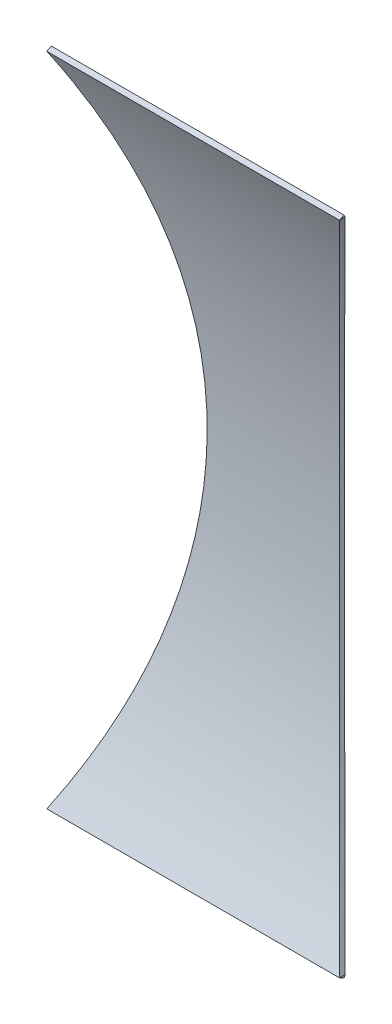
ISO-10303-21;
HEADER;
FILE_DESCRIPTION(('STEP AP214'),'2;1');
FILE_NAME('part.step','',(''),(''),'','','');
FILE_SCHEMA(('AUTOMOTIVE_DESIGN { 1 0 10303 214 1 1 1 1 }'));
ENDSEC;
DATA;
#1=APPLICATION_CONTEXT('core data for automotive mechanical design processes');
#2=APPLICATION_PROTOCOL_DEFINITION('international standard','automotive_design',2000,#1);
#3=PRODUCT_CONTEXT('',#1,'mechanical');
#4=PRODUCT('Part','Part','',(#3));
#5=PRODUCT_RELATED_PRODUCT_CATEGORY('part','',(#4));
#6=PRODUCT_DEFINITION_FORMATION('','',#4);
#7=PRODUCT_DEFINITION_CONTEXT('part definition',#1,'design');
#8=PRODUCT_DEFINITION('design','',#6,#7);
#9=PRODUCT_DEFINITION_SHAPE('','',#8);
#10=(LENGTH_UNIT() NAMED_UNIT(*) SI_UNIT(.MILLI.,.METRE.));
#11=(NAMED_UNIT(*) PLANE_ANGLE_UNIT() SI_UNIT($,.RADIAN.));
#12=(NAMED_UNIT(*) SI_UNIT($,.STERADIAN.) SOLID_ANGLE_UNIT());
#13=UNCERTAINTY_MEASURE_WITH_UNIT(LENGTH_MEASURE(1.E-05),#10,'distance_accuracy_value','');
#14=(GEOMETRIC_REPRESENTATION_CONTEXT(3) GLOBAL_UNCERTAINTY_ASSIGNED_CONTEXT((#13)) GLOBAL_UNIT_ASSIGNED_CONTEXT((#10,
#11,#12)) REPRESENTATION_CONTEXT('',''));
#15=CARTESIAN_POINT('',(0.,0.,0.));
#16=DIRECTION('',(0.,0.,1.));
#17=DIRECTION('',(1.,0.,0.));
#18=AXIS2_PLACEMENT_3D('',#15,#16,#17);
#19=CARTESIAN_POINT('',(0.,0.,247.991935352745));
#20=DIRECTION('',(1.,0.,0.));
#21=DIRECTION('',(0.,0.,-1.));
#22=AXIS2_PLACEMENT_3D('',#19,#20,#21);
#23=PLANE('',#22);
#24=DIRECTION('',(0.,0.,1.));
#25=VECTOR('',#24,1.);
#26=CARTESIAN_POINT('',(0.,130.,-34.0080646472551));
#27=LINE('',#26,#25);
#28=CARTESIAN_POINT('',(0.,130.,-2.25594176112778));
#29=VERTEX_POINT('',#28);
#30=CARTESIAN_POINT('',(0.,130.,0.));
#31=VERTEX_POINT('',#30);
#32=EDGE_CURVE('E11',#29,#31,#27,.T.);
#33=ORIENTED_EDGE('',*,*,#32,.F.);
#34=CARTESIAN_POINT('',(0.,0.,247.991935352745));
#35=DIRECTION('',(1.,0.,0.));
#36=DIRECTION('',(0.,0.,-1.));
#37=AXIS2_PLACEMENT_3D('',#34,#35,#36);
#38=CIRCLE('',#37,282.);
#39=CARTESIAN_POINT('',(0.,130.928571428571,-1.77137096680536));
#40=VERTEX_POINT('',#39);
#41=EDGE_CURVE('E81',#29,#40,#38,.T.);
#42=ORIENTED_EDGE('',*,*,#41,.T.);
#43=DIRECTION('',(0.,-0.464285714285713,0.885685483402661));
#44=VECTOR('',#43,1.);
#45=CARTESIAN_POINT('',(0.,130.,0.));
#46=LINE('',#45,#44);
#47=EDGE_CURVE('E84',#40,#31,#46,.T.);
#48=ORIENTED_EDGE('',*,*,#47,.T.);
#49=EDGE_LOOP('',(#33,#42,#48));
#50=FACE_BOUND('',#49,.T.);
#51=ADVANCED_FACE('F39',(#50),#23,.T.);
#52=CARTESIAN_POINT('',(-116.,0.,247.991935352745));
#53=DIRECTION('',(1.,0.,0.));
#54=DIRECTION('',(0.,0.,-1.));
#55=AXIS2_PLACEMENT_3D('',#52,#53,#54);
#56=PLANE('',#55);
#57=CARTESIAN_POINT('',(-116.,0.,247.991935352745));
#58=DIRECTION('',(1.,0.,0.));
#59=DIRECTION('',(0.,0.,-1.));
#60=AXIS2_PLACEMENT_3D('',#57,#58,#59);
#61=CIRCLE('',#60,282.);
#62=CARTESIAN_POINT('',(-116.,130.,-2.25594176112789));
#63=VERTEX_POINT('',#62);
#64=CARTESIAN_POINT('',(-116.,130.928571428571,-1.77137096680536));
#65=VERTEX_POINT('',#64);
#66=EDGE_CURVE('E63',#63,#65,#61,.T.);
#67=ORIENTED_EDGE('',*,*,#66,.F.);
#68=DIRECTION('',(0.,0.,1.));
#69=VECTOR('',#68,1.);
#70=CARTESIAN_POINT('',(-116.,130.,-34.0080646472551));
#71=LINE('',#70,#69);
#72=CARTESIAN_POINT('',(-116.,130.,0.));
#73=VERTEX_POINT('',#72);
#74=EDGE_CURVE('E116',#63,#73,#71,.T.);
#75=ORIENTED_EDGE('',*,*,#74,.T.);
#76=DIRECTION('',(0.,-0.464285714285713,0.885685483402661));
#77=VECTOR('',#76,1.);
#78=CARTESIAN_POINT('',(-116.,130.,0.));
#79=LINE('',#78,#77);
#80=EDGE_CURVE('E114',#65,#73,#79,.T.);
#81=ORIENTED_EDGE('',*,*,#80,.F.);
#82=EDGE_LOOP('',(#67,#75,#81));
#83=FACE_BOUND('',#82,.T.);
#84=ADVANCED_FACE('F171',(#83),#56,.F.);
#85=CARTESIAN_POINT('',(-116.,0.,247.991935352745));
#86=DIRECTION('',(1.,0.,0.));
#87=DIRECTION('',(0.,0.,-1.));
#88=AXIS2_PLACEMENT_3D('',#85,#86,#87);
#89=CYLINDRICAL_SURFACE('',#88,280.);
#90=CARTESIAN_POINT('',(247.991935352745,0.,247.991935352745));
#91=DIRECTION('',(0.707106781186547,0.,-0.707106781186548));
#92=DIRECTION('',(0.707106781186547,0.,0.707106781186548));
#93=AXIS2_PLACEMENT_3D('',#90,#91,#92);
#94=ELLIPSE('',#93,395.979797464467,280.);
#95=CARTESIAN_POINT('',(0.,-130.,0.));
#96=VERTEX_POINT('',#95);
#97=EDGE_CURVE('E126',#31,#96,#94,.F.);
#98=ORIENTED_EDGE('',*,*,#97,.F.);
#99=DIRECTION('',(1.,0.,0.));
#100=VECTOR('',#99,1.);
#101=CARTESIAN_POINT('',(-116.,130.,0.));
#102=LINE('',#101,#100);
#103=EDGE_CURVE('E95',#73,#31,#102,.T.);
#104=ORIENTED_EDGE('',*,*,#103,.F.);
#105=CARTESIAN_POINT('',(-116.,-130.,0.));
#106=CARTESIAN_POINT('',(-114.722723330829,-127.524162938112,-1.29787727621307));
#107=CARTESIAN_POINT('',(-113.475343646027,-125.016654774825,-2.5650570089339));
#108=CARTESIAN_POINT('',(-111.043760146061,-119.939533424443,-5.03469579068115));
#109=CARTESIAN_POINT('',(-109.859562959161,-117.369913762366,-6.23714804948319));
#110=CARTESIAN_POINT('',(-107.557017225669,-112.168116071115,-8.57472600666595));
#111=CARTESIAN_POINT('',(-106.438725500063,-109.535886728974,-9.70979361477241));
#112=CARTESIAN_POINT('',(-104.272701561712,-104.21303579432,-11.9079180963217));
#113=CARTESIAN_POINT('',(-103.224967370836,-101.52241584163,-12.970976988586));
#114=CARTESIAN_POINT('',(-101.19811165675,-96.0702635021348,-15.0271494382682));
#115=CARTESIAN_POINT('',(-100.219395231419,-93.3084245406909,-16.0198501788659));
#116=CARTESIAN_POINT('',(-98.3405208987038,-87.7308943374464,-17.9252979664128));
#117=CARTESIAN_POINT('',(-97.4403636225072,-84.9152026631844,-18.8380443709644));
#118=CARTESIAN_POINT('',(-95.7223884858511,-79.2340438699705,-20.5798264819451));
#119=CARTESIAN_POINT('',(-94.9045502470825,-76.3685892769392,-21.4088829062119));
#120=CARTESIAN_POINT('',(-93.3543904447992,-70.5910751649641,-22.9801334090334));
#121=CARTESIAN_POINT('',(-92.62206872685,-67.6790157301948,-23.7223276444527));
#122=CARTESIAN_POINT('',(-91.2424364093004,-61.796651332234,-25.1204271978503));
#123=CARTESIAN_POINT('',(-90.5956104083632,-58.8261155585997,-25.7758406668304));
#124=CARTESIAN_POINT('',(-89.3947277280218,-52.8472190948232,-26.9925700146317));
#125=CARTESIAN_POINT('',(-88.8406712025796,-49.8388583419148,-27.5538857372867));
#126=CARTESIAN_POINT('',(-87.8280057897651,-43.789428051778,-28.5797527770302));
#127=CARTESIAN_POINT('',(-87.3694055000559,-40.7483555941546,-29.044295377848));
#128=CARTESIAN_POINT('',(-86.5500569512581,-34.6395937424088,-29.8742191114178));
#129=CARTESIAN_POINT('',(-86.1893084259521,-31.5719044207242,-30.2396005139495));
#130=CARTESIAN_POINT('',(-85.5686159902112,-25.4265479797368,-30.8682416383489));
#131=CARTESIAN_POINT('',(-85.3083339095689,-22.3489501235614,-31.1318439497253));
#132=CARTESIAN_POINT('',(-84.8882338622004,-16.1798672768381,-31.5572936687292));
#133=CARTESIAN_POINT('',(-84.7284162511558,-13.0883822371635,-31.7191407161052));
#134=CARTESIAN_POINT('',(-84.5101243973419,-6.89843316565551,-31.9402027873517));
#135=CARTESIAN_POINT('',(-84.4516415782102,-3.79996974665675,-31.9994264966394));
#136=CARTESIAN_POINT('',(-84.4363158758933,2.39743458594207,-32.0149464514879));
#137=CARTESIAN_POINT('',(-84.4794712957186,5.49637549070603,-31.9712444155351));
#138=CARTESIAN_POINT('',(-84.6600423377646,11.4527262818252,-31.7883825773702));
#139=CARTESIAN_POINT('',(-84.7900467065086,14.3105971113168,-31.6567281780365));
#140=CARTESIAN_POINT('',(-85.136013869669,20.0157415064872,-31.3063596707759));
#141=CARTESIAN_POINT('',(-85.3519753117135,22.86301523818,-31.0876469325472));
#142=CARTESIAN_POINT('',(-85.8688599935113,28.5418072668753,-30.5641557395125));
#143=CARTESIAN_POINT('',(-86.1697811860132,31.3733259418467,-30.259379358558));
#144=CARTESIAN_POINT('',(-86.8552342610493,37.0157756563583,-29.56510789991));
#145=CARTESIAN_POINT('',(-87.2397664742604,39.8267066144298,-29.1756124871576));
#146=CARTESIAN_POINT('',(-88.0918886732042,45.4307574495006,-28.312435588121));
#147=CARTESIAN_POINT('',(-88.5596972651142,48.2238099008621,-27.8385325241471));
#148=CARTESIAN_POINT('',(-89.5756790468747,53.7801078385699,-26.8092347696776));
#149=CARTESIAN_POINT('',(-90.1238524979642,56.5433532279922,-26.2538398142795));
#150=CARTESIAN_POINT('',(-91.2982653639441,62.0357520748552,-25.063847842397));
#151=CARTESIAN_POINT('',(-91.9244994066936,64.7649078641404,-24.4292562762308));
#152=CARTESIAN_POINT('',(-93.2525906929677,70.1855733129682,-23.0833013690732));
#153=CARTESIAN_POINT('',(-93.9544469569309,72.877083459638,-22.3719390225206));
#154=CARTESIAN_POINT('',(-95.3646474465555,77.9785642819669,-20.942471226618));
#155=CARTESIAN_POINT('',(-96.0667170124749,80.3920635547061,-20.2307404834665));
#156=CARTESIAN_POINT('',(-97.5292650116236,85.1830557810643,-18.7478920362414));
#157=CARTESIAN_POINT('',(-98.2897478340257,87.5605460128629,-17.9767698694836));
#158=CARTESIAN_POINT('',(-99.86694445199,92.2773478935686,-16.3773006619038));
#159=CARTESIAN_POINT('',(-100.683659360368,94.6166587857844,-15.5489524885956));
#160=CARTESIAN_POINT('',(-102.371133474134,99.2553089941615,-13.8371988942839));
#161=CARTESIAN_POINT('',(-103.241893213486,101.554647915112,-12.9537929293088));
#162=CARTESIAN_POINT('',(-105.030446824835,106.099589949925,-11.1389823208349));
#163=CARTESIAN_POINT('',(-105.947963941999,108.345414840322,-10.2078599583388));
#164=CARTESIAN_POINT('',(-107.832129629657,112.794715119056,-8.29543430878201));
#165=CARTESIAN_POINT('',(-108.798778953458,114.998189857357,-7.31413025232295));
#166=CARTESIAN_POINT('',(-110.778607127164,119.360690006526,-5.30392140519831));
#167=CARTESIAN_POINT('',(-111.791765266107,121.519734594106,-4.27503780082809));
#168=CARTESIAN_POINT('',(-113.862833828958,125.793379633076,-2.1714085836739));
#169=CARTESIAN_POINT('',(-114.920741504858,127.907982801649,-1.09666578700441));
#170=CARTESIAN_POINT('',(-116.,130.,0.));
#171=B_SPLINE_CURVE_WITH_KNOTS('',3,(#105,#106,#107,#108,#109,#110,#111,#112,#113,#114,#115,
#116,#117,#118,#119,#120,#121,#122,#123,#124,#125,#126,#127,#128,#129,#130,#131,#132,#133,#134,
#135,#136,#137,#138,#139,#140,#141,#142,#143,#144,#145,#146,#147,#148,#149,#150,#151,#152,#153,
#154,#155,#156,#157,#158,#159,#160,#161,#162,#163,#164,#165,#166,#167,#168,#169,#170),
.UNSPECIFIED.,.F.,.F.,(4,2,2,2,2,2,2,2,2,2,2,2,2,2,2,2,2,2,2,2,2,2,2,2,2,2,2,2,2,2,2,2,4),(0.,
9.21987606005242,18.4407174521742,27.6693957521353,36.8978152116175,46.1765339984319,
55.4553273287988,64.7318179891294,74.0082918967726,83.3352763276758,92.6622762376653,
101.990115859536,111.317930103663,120.614067263075,129.910237334095,139.205620595217,
148.500848658289,157.089804201092,165.67862461827,174.267238090697,182.855885531231,
191.467420471209,200.078983405001,208.689954016707,217.300813100886,225.13632493729,
232.972426111189,240.808682403726,248.645016130856,256.439397814142,264.233899038716,
272.024962321094,279.815547857613),.UNSPECIFIED.);
#172=CARTESIAN_POINT('',(-116.,-130.,0.));
#173=VERTEX_POINT('',#172);
#174=EDGE_CURVE('E136',#173,#73,#171,.T.);
#175=ORIENTED_EDGE('',*,*,#174,.F.);
#176=DIRECTION('',(1.,0.,0.));
#177=VECTOR('',#176,1.);
#178=CARTESIAN_POINT('',(-116.,-130.,0.));
#179=LINE('',#178,#177);
#180=EDGE_CURVE('E111',#173,#96,#179,.T.);
#181=ORIENTED_EDGE('',*,*,#180,.T.);
#182=EDGE_LOOP('',(#98,#104,#175,#181));
#183=FACE_BOUND('',#182,.T.);
#184=ADVANCED_FACE('F41',(#183),#89,.F.);
#185=CARTESIAN_POINT('',(-116.,130.,0.));
#186=DIRECTION('',(0.,0.885685483402661,0.464285714285713));
#187=DIRECTION('',(0.,-0.464285714285713,0.885685483402661));
#188=AXIS2_PLACEMENT_3D('',#185,#186,#187);
#189=PLANE('',#188);
#190=ORIENTED_EDGE('',*,*,#47,.F.);
#191=DIRECTION('',(1.,0.,0.));
#192=VECTOR('',#191,1.);
#193=CARTESIAN_POINT('',(-116.,130.928571428571,-1.77137096680536));
#194=LINE('',#193,#192);
#195=EDGE_CURVE('E90',#65,#40,#194,.T.);
#196=ORIENTED_EDGE('',*,*,#195,.F.);
#197=ORIENTED_EDGE('',*,*,#80,.T.);
#198=ORIENTED_EDGE('',*,*,#103,.T.);
#199=EDGE_LOOP('',(#190,#196,#197,#198));
#200=FACE_BOUND('',#199,.T.);
#201=ADVANCED_FACE('F99',(#200),#189,.T.);
#202=CARTESIAN_POINT('',(-116.,0.,247.991935352745));
#203=DIRECTION('',(1.,0.,0.));
#204=DIRECTION('',(0.,0.,-1.));
#205=AXIS2_PLACEMENT_3D('',#202,#203,#204);
#206=CYLINDRICAL_SURFACE('',#205,282.);
#207=CARTESIAN_POINT('',(2.27665296273957,-134.253491574707,0.));
#208=CARTESIAN_POINT('',(0.935117675793695,-131.798195494847,-1.32922030930003));
#209=CARTESIAN_POINT('',(-0.376391872368636,-129.31033500008,-2.62888792698343));
#210=CARTESIAN_POINT('',(-2.93597820274941,-124.270547445869,-5.16570067044621));
#211=CARTESIAN_POINT('',(-4.18404825225721,-121.718613629206,-6.40283916005253));
#212=CARTESIAN_POINT('',(-6.6141548579054,-116.549994596502,-8.81195048180822));
#213=CARTESIAN_POINT('',(-7.79613248238871,-113.933254502929,-9.98386515258511));
#214=CARTESIAN_POINT('',(-10.0892082263198,-108.639056354845,-12.2576653328067));
#215=CARTESIAN_POINT('',(-11.2003083369752,-105.961600008943,-13.3595528095671));
#216=CARTESIAN_POINT('',(-13.3546570694715,-100.531306461915,-15.4962471464442));
#217=CARTESIAN_POINT('',(-14.3974425360891,-97.7781049422107,-16.5305959823338));
#218=CARTESIAN_POINT('',(-16.4038471232867,-92.2150391955739,-18.5209419062146));
#219=CARTESIAN_POINT('',(-17.3674655988696,-89.4051745072218,-19.4769383558452));
#220=CARTESIAN_POINT('',(-19.2115978008285,-83.732693154396,-21.3066254787235));
#221=CARTESIAN_POINT('',(-20.0921323840438,-80.8700899458844,-22.1803368081877));
#222=CARTESIAN_POINT('',(-21.7667703340158,-75.0951339858171,-23.842110645009));
#223=CARTESIAN_POINT('',(-22.5608738561576,-72.1827813237116,-24.6301733063445));
#224=CARTESIAN_POINT('',(-24.0634336527399,-66.2959723670908,-26.1213902384615));
#225=CARTESIAN_POINT('',(-24.7713819243215,-63.3212585440484,-26.8240408630707));
#226=CARTESIAN_POINT('',(-26.0931169754834,-57.330557273332,-28.1359506714764));
#227=CARTESIAN_POINT('',(-26.7069035933206,-54.3145697547711,-28.7452096948526));
#228=CARTESIAN_POINT('',(-27.8373867619313,-48.2463578892101,-29.8674000437035));
#229=CARTESIAN_POINT('',(-28.3540743984049,-45.1941302424587,-30.3803225248726));
#230=CARTESIAN_POINT('',(-29.2876727005291,-39.0595065376342,-31.3071478741717));
#231=CARTESIAN_POINT('',(-29.7045836646313,-35.9771105698292,-31.7210510384879));
#232=CARTESIAN_POINT('',(-30.4350665042448,-29.8000105944188,-32.4462814767917));
#233=CARTESIAN_POINT('',(-30.7490216581611,-26.7053966615558,-32.7579891975177));
#234=CARTESIAN_POINT('',(-31.2740597552177,-20.4988551279803,-33.279277255542));
#235=CARTESIAN_POINT('',(-31.4851423047764,-17.3869274610731,-33.4888572021084));
#236=CARTESIAN_POINT('',(-31.8032675244219,-11.1528031897002,-33.8047204022652));
#237=CARTESIAN_POINT('',(-31.9103194731807,-8.03060752598382,-33.9110128682473));
#238=CARTESIAN_POINT('',(-32.0198218043993,-1.7826072907651,-34.0197383460858));
#239=CARTESIAN_POINT('',(-32.0222741093189,1.34319721335359,-34.0221732667629));
#240=CARTESIAN_POINT('',(-31.9266330430547,7.33717123784409,-33.9272106940811));
#241=CARTESIAN_POINT('',(-31.8367057070327,10.2056061426051,-33.8379213066773));
#242=CARTESIAN_POINT('',(-31.5690070583417,15.9342849111967,-33.5721253278295));
#243=CARTESIAN_POINT('',(-31.3912372795732,18.7945289171793,-33.3956202593414));
#244=CARTESIAN_POINT('',(-30.9486820436902,24.501492700741,-32.95622238803));
#245=CARTESIAN_POINT('',(-30.6838998393764,27.348212979845,-32.6933328145336));
#246=CARTESIAN_POINT('',(-30.0685182969272,33.0231766568737,-32.0823664503272));
#247=CARTESIAN_POINT('',(-29.7179184706601,35.8514199496072,-31.7342891750684));
#248=CARTESIAN_POINT('',(-28.9312222813765,41.4934097541813,-30.9532796958926));
#249=CARTESIAN_POINT('',(-28.4948607895668,44.3070828118076,-30.5200843539104));
#250=CARTESIAN_POINT('',(-27.5392359191655,49.9063114157163,-29.571432229166));
#251=CARTESIAN_POINT('',(-27.0199726850957,52.6918670110066,-29.0559755898091));
#252=CARTESIAN_POINT('',(-25.90073215096,58.230479473378,-27.9449935063407));
#253=CARTESIAN_POINT('',(-25.3007575700179,60.9835374318903,-27.3494707596157));
#254=CARTESIAN_POINT('',(-24.0224860406333,66.4533138953713,-26.0807545715693));
#255=CARTESIAN_POINT('',(-23.3441886145254,69.1700321786032,-25.4075606565567));
#256=CARTESIAN_POINT('',(-21.8815001015779,74.6778971683427,-23.9559691041785));
#257=CARTESIAN_POINT('',(-21.0938302832881,77.4673163509014,-23.1743212917555));
#258=CARTESIAN_POINT('',(-19.4393121976776,82.9991741120347,-21.5325749282822));
#259=CARTESIAN_POINT('',(-18.5724631094328,85.7416122031631,-20.6724755638528));
#260=CARTESIAN_POINT('',(-16.7626019654152,91.1769806076692,-18.8768567337411));
#261=CARTESIAN_POINT('',(-15.819571378023,93.8698986782351,-17.9413189172917));
#262=CARTESIAN_POINT('',(-13.8608211725699,99.2028397791875,-15.9983120871917));
#263=CARTESIAN_POINT('',(-12.8451004028696,101.84286197069,-14.9908419339091));
#264=CARTESIAN_POINT('',(-10.7500779518007,107.053313232729,-12.9130503611674));
#265=CARTESIAN_POINT('',(-9.67115540800851,109.624044507817,-11.8431038307349));
#266=CARTESIAN_POINT('',(-7.44796732067376,114.709007289967,-9.63865898073473));
#267=CARTESIAN_POINT('',(-6.30370008796006,117.223237334122,-8.50415899245221));
#268=CARTESIAN_POINT('',(-3.95404496674838,122.191520936774,-6.17484689239917));
#269=CARTESIAN_POINT('',(-2.74870784656741,124.645622042615,-4.98008488095269));
#270=CARTESIAN_POINT('',(-0.279308243514607,129.494372520429,-2.5326811086385));
#271=CARTESIAN_POINT('',(0.984748637677214,131.889027530069,-1.28004486885112));
#272=CARTESIAN_POINT('',(2.27665296273955,134.253491574707,0.));
#273=B_SPLINE_CURVE_WITH_KNOTS('',3,(#207,#208,#209,#210,#211,#212,#213,#214,#215,#216,#217,
#218,#219,#220,#221,#222,#223,#224,#225,#226,#227,#228,#229,#230,#231,#232,#233,#234,#235,#236,
#237,#238,#239,#240,#241,#242,#243,#244,#245,#246,#247,#248,#249,#250,#251,#252,#253,#254,#255,
#256,#257,#258,#259,#260,#261,#262,#263,#264,#265,#266,#267,#268,#269,#270,#271,#272),
.UNSPECIFIED.,.F.,.F.,(4,2,2,2,2,2,2,2,2,2,2,2,2,2,2,2,2,2,2,2,2,2,2,2,2,2,2,2,2,2,2,2,4),(0.,
9.29248029486335,18.5859447322922,27.8875677598261,37.1889293556993,46.5479326496566,
55.9070121866458,65.2637359955282,74.6204429826906,84.0298913606214,93.4393559011483,
102.849683868401,112.259983687155,121.634842781838,131.009737743636,140.383796465325,
149.757682899048,158.368734723078,166.979636186655,175.590215784026,184.200844359631,
192.838523380005,201.476187342558,210.113560379492,218.750986095738,227.7545988717,
236.758305006974,245.764207982847,254.770253671943,263.726920715456,272.683819395203,
281.633390483826,290.582109557879),.UNSPECIFIED.);
#274=CARTESIAN_POINT('',(0.,-130.,-2.25594176112778));
#275=VERTEX_POINT('',#274);
#276=EDGE_CURVE('E124',#275,#29,#273,.T.);
#277=ORIENTED_EDGE('',*,*,#276,.F.);
#278=CARTESIAN_POINT('',(0.,-130.928571428572,-1.77137096680527));
#279=VERTEX_POINT('',#278);
#280=EDGE_CURVE('E87',#279,#275,#38,.T.);
#281=ORIENTED_EDGE('',*,*,#280,.F.);
#282=DIRECTION('',(1.,0.,0.));
#283=VECTOR('',#282,1.);
#284=CARTESIAN_POINT('',(-116.,-130.928571428572,-1.77137096680527));
#285=LINE('',#284,#283);
#286=CARTESIAN_POINT('',(-116.,-130.928571428572,-1.77137096680527));
#287=VERTEX_POINT('',#286);
#288=EDGE_CURVE('E96',#287,#279,#285,.T.);
#289=ORIENTED_EDGE('',*,*,#288,.F.);
#290=CARTESIAN_POINT('',(-116.,-130.,-2.25594176112795));
#291=VERTEX_POINT('',#290);
#292=EDGE_CURVE('E165',#287,#291,#61,.T.);
#293=ORIENTED_EDGE('',*,*,#292,.T.);
#294=CARTESIAN_POINT('',(-116.,130.,-2.25594176112789));
#295=CARTESIAN_POINT('',(-114.706972972979,127.493633811334,-3.55797973253189));
#296=CARTESIAN_POINT('',(-113.444716213032,124.95506441345,-4.82889395519683));
#297=CARTESIAN_POINT('',(-110.985194481577,119.814802866107,-7.30504852001937));
#298=CARTESIAN_POINT('',(-109.787936674385,117.213103803913,-8.51028162272689));
#299=CARTESIAN_POINT('',(-107.460999010154,111.945812952544,-10.8525182537096));
#300=CARTESIAN_POINT('',(-106.331387220961,109.280160466009,-11.9894530612899));
#301=CARTESIAN_POINT('',(-104.144733515119,103.88959970978,-14.1901117078072));
#302=CARTESIAN_POINT('',(-103.087689308892,101.16469331318,-15.2538378565517));
#303=CARTESIAN_POINT('',(-101.045742338958,95.6470251936855,-17.3085501464189));
#304=CARTESIAN_POINT('',(-100.061144316755,92.8540360693959,-18.2992290508284));
#305=CARTESIAN_POINT('',(-98.1724736169432,87.2137499867754,-20.1994466610909));
#306=CARTESIAN_POINT('',(-97.2683999348509,84.3664537064256,-21.1089863790974));
#307=CARTESIAN_POINT('',(-95.5446960099586,78.6220470511753,-22.8430174624145));
#308=CARTESIAN_POINT('',(-94.7250351195731,75.7249552044146,-23.6675396949896));
#309=CARTESIAN_POINT('',(-93.1732753177986,69.8839750056387,-25.2284290532566));
#310=CARTESIAN_POINT('',(-92.4411737387622,66.9400880824146,-25.9647988646665));
#311=CARTESIAN_POINT('',(-91.1570286412514,61.3952988760573,-27.2563784161428));
#312=CARTESIAN_POINT('',(-90.5939493582898,58.7995300312345,-27.8226950495027));
#313=CARTESIAN_POINT('',(-89.5385441095444,53.5792417822817,-28.8841358546064));
#314=CARTESIAN_POINT('',(-89.0462162972761,50.9547231303939,-29.3792618842955));
#315=CARTESIAN_POINT('',(-88.1341210552416,45.6804311538168,-30.2965176966812));
#316=CARTESIAN_POINT('',(-87.714353571622,43.0306578478727,-30.7186475335547));
#317=CARTESIAN_POINT('',(-86.94897625557,37.7096190861452,-31.4883162258517));
#318=CARTESIAN_POINT('',(-86.6033668783025,35.0383534985516,-31.8358546234507));
#319=CARTESIAN_POINT('',(-85.988469024276,29.6853446466905,-32.4541746058));
#320=CARTESIAN_POINT('',(-85.7189840435859,27.0036468149472,-32.7251538171329));
#321=CARTESIAN_POINT('',(-85.2562185698741,21.6270730250786,-33.1904799155302));
#322=CARTESIAN_POINT('',(-85.0629374443563,18.9321971765196,-33.3848274386416));
#323=CARTESIAN_POINT('',(-84.7533527847257,13.5333653289065,-33.6961180637561));
#324=CARTESIAN_POINT('',(-84.6370546107444,10.8294087107527,-33.8130557759064));
#325=CARTESIAN_POINT('',(-84.4819321328617,5.4169835715623,-33.9690309316354));
#326=CARTESIAN_POINT('',(-84.4431097603119,2.7085149397327,-34.0080664332325));
#327=CARTESIAN_POINT('',(-84.4431135862772,-3.09830579536675,-34.0080626042521));
#328=CARTESIAN_POINT('',(-84.4939184831952,-6.19667218634935,-33.9569788165889));
#329=CARTESIAN_POINT('',(-84.6968704293429,-12.3867710622431,-33.7529109871748));
#330=CARTESIAN_POINT('',(-84.8490203458111,-15.4785033569806,-33.5999240623951));
#331=CARTESIAN_POINT('',(-85.2538705000206,-21.6490950642401,-33.1928407062957));
#332=CARTESIAN_POINT('',(-85.5065836550759,-24.7279527716664,-32.9387312858255));
#333=CARTESIAN_POINT('',(-86.1112194360957,-30.8659646729292,-32.3307421797119));
#334=CARTESIAN_POINT('',(-86.4631412932892,-33.9251190192596,-31.976863267185));
#335=CARTESIAN_POINT('',(-87.265691543471,-40.0276660898874,-31.169828309067));
#336=CARTESIAN_POINT('',(-87.7166409132071,-43.0709738304091,-30.7163494304061));
#337=CARTESIAN_POINT('',(-88.7142937521868,-49.1258466147645,-29.7130671783126));
#338=CARTESIAN_POINT('',(-89.2609980430787,-52.1374113859848,-29.163262978337));
#339=CARTESIAN_POINT('',(-90.4474116885896,-58.12297791964,-27.9700750073772));
#340=CARTESIAN_POINT('',(-91.0871086674362,-61.0969846232739,-27.3267036886074));
#341=CARTESIAN_POINT('',(-92.4565707549078,-67.0028865177186,-25.9493121929999));
#342=CARTESIAN_POINT('',(-93.1863339422742,-69.9347826053283,-25.2152939498081));
#343=CARTESIAN_POINT('',(-94.6388749169269,-75.3991654165889,-23.7542064973824));
#344=CARTESIAN_POINT('',(-95.3517618779415,-77.9369603012234,-23.0370951372625));
#345=CARTESIAN_POINT('',(-96.842312937588,-82.9741947417373,-21.5376342948803));
#346=CARTESIAN_POINT('',(-97.6199822168406,-85.473631211143,-20.755279595124));
#347=CARTESIAN_POINT('',(-99.2376406995792,-90.4315445974574,-19.1277819911973));
#348=CARTESIAN_POINT('',(-100.0776303216,-92.8900212391497,-18.2826386653469));
#349=CARTESIAN_POINT('',(-101.817474531063,-97.7639378623978,-16.5320097293093));
#350=CARTESIAN_POINT('',(-102.717329779007,-100.179377368748,-15.6265234533526));
#351=CARTESIAN_POINT('',(-104.568798042054,-104.950919855792,-13.7633408148336));
#352=CARTESIAN_POINT('',(-105.520065631126,-107.307293100833,-12.8059928155815));
#353=CARTESIAN_POINT('',(-107.476846803947,-111.974223243687,-10.8365566979689));
#354=CARTESIAN_POINT('',(-108.482361301608,-114.284779368709,-9.82446765737037));
#355=CARTESIAN_POINT('',(-110.544692508356,-118.857647915211,-7.7484828395064));
#356=CARTESIAN_POINT('',(-111.601484358329,-121.119982963415,-6.68461216506568));
#357=CARTESIAN_POINT('',(-113.764357424168,-125.596393610845,-4.50705826872474));
#358=CARTESIAN_POINT('',(-114.870435237358,-127.810472525982,-3.39337848559928));
#359=CARTESIAN_POINT('',(-116.,-130.,-2.25594176112797));
#360=B_SPLINE_CURVE_WITH_KNOTS('',3,(#294,#295,#296,#297,#298,#299,#300,#301,#302,#303,#304,
#305,#306,#307,#308,#309,#310,#311,#312,#313,#314,#315,#316,#317,#318,#319,#320,#321,#322,#323,
#324,#325,#326,#327,#328,#329,#330,#331,#332,#333,#334,#335,#336,#337,#338,#339,#340,#341,#342,
#343,#344,#345,#346,#347,#348,#349,#350,#351,#352,#353,#354,#355,#356,#357,#358,#359),
.UNSPECIFIED.,.F.,.F.,(4,2,2,2,2,2,2,2,2,2,2,2,2,2,2,2,2,2,2,2,2,2,2,2,2,2,2,2,2,2,2,2,4),(0.,
9.31861366664866,18.6382523730552,27.9671164880235,37.2956861327765,46.6614847469103,
56.0271665130295,65.389435822022,74.7514198204494,82.8970165914695,91.0424007386055,
99.1877788402956,107.333206934948,115.457412549646,123.581550731589,131.706254517603,
139.83116083737,149.125347835588,158.419797794765,167.715442008478,177.011014191972,
186.33717280838,195.663411454083,204.988410067664,214.313209798258,222.506875899963,
230.70119787665,238.895574890271,247.090042328199,255.235017674441,263.380130284209,
271.521332868652,279.661974257018),.UNSPECIFIED.);
#361=EDGE_CURVE('E55',#63,#291,#360,.T.);
#362=ORIENTED_EDGE('',*,*,#361,.F.);
#363=ORIENTED_EDGE('',*,*,#66,.T.);
#364=ORIENTED_EDGE('',*,*,#195,.T.);
#365=ORIENTED_EDGE('',*,*,#41,.F.);
#366=EDGE_LOOP('',(#277,#281,#289,#293,#362,#363,#364,#365));
#367=FACE_BOUND('',#366,.T.);
#368=ADVANCED_FACE('F91',(#367),#206,.T.);
#369=CARTESIAN_POINT('',(-116.,-130.,0.));
#370=DIRECTION('',(0.,-0.88568548340266,0.464285714285714));
#371=DIRECTION('',(0.,-0.464285714285714,-0.88568548340266));
#372=AXIS2_PLACEMENT_3D('',#369,#370,#371);
#373=PLANE('',#372);
#374=DIRECTION('',(0.,-0.464285714285714,-0.88568548340266));
#375=VECTOR('',#374,1.);
#376=CARTESIAN_POINT('',(0.,-130.,0.));
#377=LINE('',#376,#375);
#378=EDGE_CURVE('E88',#96,#279,#377,.T.);
#379=ORIENTED_EDGE('',*,*,#378,.F.);
#380=ORIENTED_EDGE('',*,*,#180,.F.);
#381=DIRECTION('',(0.,-0.464285714285714,-0.88568548340266));
#382=VECTOR('',#381,1.);
#383=CARTESIAN_POINT('',(-116.,-130.,0.));
#384=LINE('',#383,#382);
#385=EDGE_CURVE('E101',#173,#287,#384,.T.);
#386=ORIENTED_EDGE('',*,*,#385,.T.);
#387=ORIENTED_EDGE('',*,*,#288,.T.);
#388=EDGE_LOOP('',(#379,#380,#386,#387));
#389=FACE_BOUND('',#388,.T.);
#390=ADVANCED_FACE('F181',(#389),#373,.T.);
#391=ORIENTED_EDGE('',*,*,#385,.F.);
#392=DIRECTION('',(0.,0.,1.));
#393=VECTOR('',#392,1.);
#394=CARTESIAN_POINT('',(-116.,-130.,-34.0080646472551));
#395=LINE('',#394,#393);
#396=EDGE_CURVE('E108',#173,#291,#395,.F.);
#397=ORIENTED_EDGE('',*,*,#396,.T.);
#398=ORIENTED_EDGE('',*,*,#292,.F.);
#399=EDGE_LOOP('',(#391,#397,#398));
#400=FACE_BOUND('',#399,.T.);
#401=ADVANCED_FACE('F153',(#400),#56,.F.);
#402=DIRECTION('',(0.,0.,1.));
#403=VECTOR('',#402,1.);
#404=CARTESIAN_POINT('',(0.,-130.,-34.0080646472551));
#405=LINE('',#404,#403);
#406=EDGE_CURVE('E48',#96,#275,#405,.F.);
#407=ORIENTED_EDGE('',*,*,#406,.F.);
#408=ORIENTED_EDGE('',*,*,#378,.T.);
#409=ORIENTED_EDGE('',*,*,#280,.T.);
#410=EDGE_LOOP('',(#407,#408,#409));
#411=FACE_BOUND('',#410,.T.);
#412=ADVANCED_FACE('F131',(#411),#23,.T.);
#413=CARTESIAN_POINT('',(-367.991935352745,0.,-34.0080646472551));
#414=DIRECTION('',(0.,0.,1.));
#415=DIRECTION('',(1.,0.,0.));
#416=AXIS2_PLACEMENT_3D('',#413,#414,#415);
#417=CYLINDRICAL_SURFACE('',#416,283.548823807862);
#418=ORIENTED_EDGE('',*,*,#361,.T.);
#419=ORIENTED_EDGE('',*,*,#396,.F.);
#420=ORIENTED_EDGE('',*,*,#174,.T.);
#421=ORIENTED_EDGE('',*,*,#74,.F.);
#422=EDGE_LOOP('',(#418,#419,#420,#421));
#423=FACE_BOUND('',#422,.T.);
#424=ADVANCED_FACE('F149',(#423),#417,.F.);
#425=CARTESIAN_POINT('',(247.991935352745,0.,-34.0080646472551));
#426=DIRECTION('',(0.,0.,1.));
#427=DIRECTION('',(1.,0.,0.));
#428=AXIS2_PLACEMENT_3D('',#425,#426,#427);
#429=CYLINDRICAL_SURFACE('',#428,280.);
#430=ORIENTED_EDGE('',*,*,#276,.T.);
#431=ORIENTED_EDGE('',*,*,#32,.T.);
#432=ORIENTED_EDGE('',*,*,#97,.T.);
#433=ORIENTED_EDGE('',*,*,#406,.T.);
#434=EDGE_LOOP('',(#430,#431,#432,#433));
#435=FACE_BOUND('',#434,.T.);
#436=ADVANCED_FACE('F123',(#435),#429,.F.);
#437=CLOSED_SHELL('',(#51,#84,#184,#201,#368,#390,#401,#412,#424,#436));
#438=MANIFOLD_SOLID_BREP('B2',#437);
#439=ADVANCED_BREP_SHAPE_REPRESENTATION('',(#18,#438),#14);
#440=SHAPE_DEFINITION_REPRESENTATION(#9,#439);
ENDSEC;
END-ISO-10303-21;
